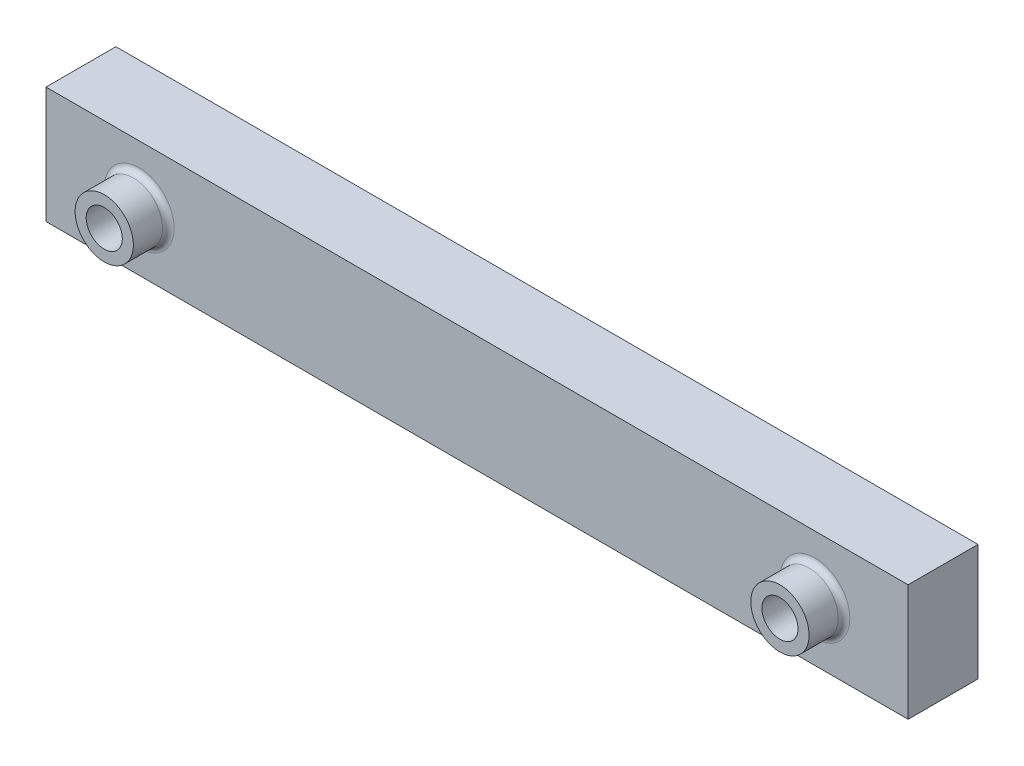
ISO-10303-21;
HEADER;
FILE_DESCRIPTION(('STEP AP214'),'2;1');
FILE_NAME('part.step','',(''),(''),'','','');
FILE_SCHEMA(('AUTOMOTIVE_DESIGN { 1 0 10303 214 1 1 1 1 }'));
ENDSEC;
DATA;
#1=APPLICATION_CONTEXT('core data for automotive mechanical design processes');
#2=APPLICATION_PROTOCOL_DEFINITION('international standard','automotive_design',2000,#1);
#3=PRODUCT_CONTEXT('',#1,'mechanical');
#4=PRODUCT('Part','Part','',(#3));
#5=PRODUCT_RELATED_PRODUCT_CATEGORY('part','',(#4));
#6=PRODUCT_DEFINITION_FORMATION('','',#4);
#7=PRODUCT_DEFINITION_CONTEXT('part definition',#1,'design');
#8=PRODUCT_DEFINITION('design','',#6,#7);
#9=PRODUCT_DEFINITION_SHAPE('','',#8);
#10=(LENGTH_UNIT() NAMED_UNIT(*) SI_UNIT(.MILLI.,.METRE.));
#11=(NAMED_UNIT(*) PLANE_ANGLE_UNIT() SI_UNIT($,.RADIAN.));
#12=(NAMED_UNIT(*) SI_UNIT($,.STERADIAN.) SOLID_ANGLE_UNIT());
#13=UNCERTAINTY_MEASURE_WITH_UNIT(LENGTH_MEASURE(1.E-05),#10,'distance_accuracy_value','');
#14=(GEOMETRIC_REPRESENTATION_CONTEXT(3) GLOBAL_UNCERTAINTY_ASSIGNED_CONTEXT((#13)) GLOBAL_UNIT_ASSIGNED_CONTEXT((#10,
#11,#12)) REPRESENTATION_CONTEXT('',''));
#15=CARTESIAN_POINT('',(0.,0.,0.));
#16=DIRECTION('',(0.,0.,1.));
#17=DIRECTION('',(1.,0.,0.));
#18=AXIS2_PLACEMENT_3D('',#15,#16,#17);
#19=CARTESIAN_POINT('',(0.,0.,6.));
#20=DIRECTION('',(0.,0.,1.));
#21=DIRECTION('',(1.,0.,0.));
#22=AXIS2_PLACEMENT_3D('',#19,#20,#21);
#23=PLANE('',#22);
#24=CARTESIAN_POINT('',(-16.0996168582375,1.33514516238047,6.));
#25=DIRECTION('',(0.,0.,1.));
#26=DIRECTION('',(1.,0.,0.));
#27=AXIS2_PLACEMENT_3D('',#24,#25,#26);
#28=CIRCLE('',#27,3.);
#29=CARTESIAN_POINT('',(-13.0996168582375,1.33514516238047,6.));
#30=VERTEX_POINT('',#29);
#31=EDGE_CURVE('E11',#30,#30,#28,.F.);
#32=ORIENTED_EDGE('',*,*,#31,.T.);
#33=EDGE_LOOP('',(#32));
#34=FACE_BOUND('',#33,.T.);
#35=CARTESIAN_POINT('',(41.9003831417625,1.33514516238047,6.));
#36=DIRECTION('',(0.,0.,1.));
#37=DIRECTION('',(1.,0.,0.));
#38=AXIS2_PLACEMENT_3D('',#35,#36,#37);
#39=CIRCLE('',#38,3.);
#40=CARTESIAN_POINT('',(44.9003831417625,1.33514516238047,6.));
#41=VERTEX_POINT('',#40);
#42=EDGE_CURVE('E121',#41,#41,#39,.F.);
#43=ORIENTED_EDGE('',*,*,#42,.T.);
#44=EDGE_LOOP('',(#43));
#45=FACE_BOUND('',#44,.T.);
#46=DIRECTION('',(0.,-1.,0.));
#47=VECTOR('',#46,1.);
#48=CARTESIAN_POINT('',(-24.0996168582375,6.33514516238047,6.));
#49=LINE('',#48,#47);
#50=CARTESIAN_POINT('',(-24.0996168582375,6.33514516238047,6.));
#51=VERTEX_POINT('',#50);
#52=CARTESIAN_POINT('',(-24.0996168582375,-3.66485483761953,6.));
#53=VERTEX_POINT('',#52);
#54=EDGE_CURVE('E87',#51,#53,#49,.T.);
#55=ORIENTED_EDGE('',*,*,#54,.T.);
#56=DIRECTION('',(1.,0.,0.));
#57=VECTOR('',#56,1.);
#58=CARTESIAN_POINT('',(-24.0996168582375,-3.66485483761953,6.));
#59=LINE('',#58,#57);
#60=CARTESIAN_POINT('',(49.9003831417625,-3.66485483761953,6.));
#61=VERTEX_POINT('',#60);
#62=EDGE_CURVE('E83',#53,#61,#59,.T.);
#63=ORIENTED_EDGE('',*,*,#62,.T.);
#64=DIRECTION('',(0.,1.,0.));
#65=VECTOR('',#64,1.);
#66=CARTESIAN_POINT('',(49.9003831417625,6.33514516238047,6.));
#67=LINE('',#66,#65);
#68=CARTESIAN_POINT('',(49.9003831417625,6.33514516238047,6.));
#69=VERTEX_POINT('',#68);
#70=EDGE_CURVE('E85',#61,#69,#67,.T.);
#71=ORIENTED_EDGE('',*,*,#70,.T.);
#72=DIRECTION('',(-1.,0.,0.));
#73=VECTOR('',#72,1.);
#74=CARTESIAN_POINT('',(-24.0996168582375,6.33514516238047,6.));
#75=LINE('',#74,#73);
#76=EDGE_CURVE('E52',#69,#51,#75,.T.);
#77=ORIENTED_EDGE('',*,*,#76,.T.);
#78=EDGE_LOOP('',(#55,#63,#71,#77));
#79=FACE_BOUND('',#78,.T.);
#80=ADVANCED_FACE('F35',(#34,#45,#79),#23,.T.);
#81=CARTESIAN_POINT('',(-24.0996168582375,6.33514516238047,6.));
#82=DIRECTION('',(1.,0.,0.));
#83=DIRECTION('',(0.,1.,0.));
#84=AXIS2_PLACEMENT_3D('',#81,#82,#83);
#85=PLANE('',#84);
#86=DIRECTION('',(0.,-1.,0.));
#87=VECTOR('',#86,1.);
#88=CARTESIAN_POINT('',(-24.0996168582375,6.33514516238047,0.));
#89=LINE('',#88,#87);
#90=CARTESIAN_POINT('',(-24.0996168582375,6.33514516238047,0.));
#91=VERTEX_POINT('',#90);
#92=CARTESIAN_POINT('',(-24.0996168582375,-3.66485483761953,0.));
#93=VERTEX_POINT('',#92);
#94=EDGE_CURVE('E102',#91,#93,#89,.T.);
#95=ORIENTED_EDGE('',*,*,#94,.T.);
#96=DIRECTION('',(0.,0.,-1.));
#97=VECTOR('',#96,1.);
#98=CARTESIAN_POINT('',(-24.0996168582375,-3.66485483761953,6.));
#99=LINE('',#98,#97);
#100=EDGE_CURVE('E93',#53,#93,#99,.T.);
#101=ORIENTED_EDGE('',*,*,#100,.F.);
#102=ORIENTED_EDGE('',*,*,#54,.F.);
#103=DIRECTION('',(0.,0.,-1.));
#104=VECTOR('',#103,1.);
#105=CARTESIAN_POINT('',(-24.0996168582375,6.33514516238047,6.));
#106=LINE('',#105,#104);
#107=EDGE_CURVE('E98',#51,#91,#106,.T.);
#108=ORIENTED_EDGE('',*,*,#107,.T.);
#109=EDGE_LOOP('',(#95,#101,#102,#108));
#110=FACE_BOUND('',#109,.T.);
#111=ADVANCED_FACE('F139',(#110),#85,.F.);
#112=CARTESIAN_POINT('',(-24.0996168582375,-3.66485483761953,6.));
#113=DIRECTION('',(0.,1.,0.));
#114=DIRECTION('',(0.,0.,1.));
#115=AXIS2_PLACEMENT_3D('',#112,#113,#114);
#116=PLANE('',#115);
#117=DIRECTION('',(1.,0.,0.));
#118=VECTOR('',#117,1.);
#119=CARTESIAN_POINT('',(-24.0996168582375,-3.66485483761953,0.));
#120=LINE('',#119,#118);
#121=CARTESIAN_POINT('',(49.9003831417625,-3.66485483761953,0.));
#122=VERTEX_POINT('',#121);
#123=EDGE_CURVE('E92',#93,#122,#120,.T.);
#124=ORIENTED_EDGE('',*,*,#123,.T.);
#125=DIRECTION('',(0.,0.,-1.));
#126=VECTOR('',#125,1.);
#127=CARTESIAN_POINT('',(49.9003831417625,-3.66485483761953,6.));
#128=LINE('',#127,#126);
#129=EDGE_CURVE('E90',#61,#122,#128,.T.);
#130=ORIENTED_EDGE('',*,*,#129,.F.);
#131=ORIENTED_EDGE('',*,*,#62,.F.);
#132=ORIENTED_EDGE('',*,*,#100,.T.);
#133=EDGE_LOOP('',(#124,#130,#131,#132));
#134=FACE_BOUND('',#133,.T.);
#135=ADVANCED_FACE('F91',(#134),#116,.F.);
#136=CARTESIAN_POINT('',(49.9003831417625,6.33514516238047,6.));
#137=DIRECTION('',(-1.,0.,0.));
#138=DIRECTION('',(0.,0.,1.));
#139=AXIS2_PLACEMENT_3D('',#136,#137,#138);
#140=PLANE('',#139);
#141=DIRECTION('',(0.,1.,0.));
#142=VECTOR('',#141,1.);
#143=CARTESIAN_POINT('',(49.9003831417625,6.33514516238047,0.));
#144=LINE('',#143,#142);
#145=CARTESIAN_POINT('',(49.9003831417625,6.33514516238047,0.));
#146=VERTEX_POINT('',#145);
#147=EDGE_CURVE('E69',#122,#146,#144,.T.);
#148=ORIENTED_EDGE('',*,*,#147,.T.);
#149=DIRECTION('',(0.,0.,-1.));
#150=VECTOR('',#149,1.);
#151=CARTESIAN_POINT('',(49.9003831417625,6.33514516238047,6.));
#152=LINE('',#151,#150);
#153=EDGE_CURVE('E94',#69,#146,#152,.T.);
#154=ORIENTED_EDGE('',*,*,#153,.F.);
#155=ORIENTED_EDGE('',*,*,#70,.F.);
#156=ORIENTED_EDGE('',*,*,#129,.T.);
#157=EDGE_LOOP('',(#148,#154,#155,#156));
#158=FACE_BOUND('',#157,.T.);
#159=ADVANCED_FACE('F96',(#158),#140,.F.);
#160=CARTESIAN_POINT('',(-24.0996168582375,6.33514516238047,6.));
#161=DIRECTION('',(0.,-1.,0.));
#162=DIRECTION('',(0.,0.,-1.));
#163=AXIS2_PLACEMENT_3D('',#160,#161,#162);
#164=PLANE('',#163);
#165=DIRECTION('',(-1.,0.,0.));
#166=VECTOR('',#165,1.);
#167=CARTESIAN_POINT('',(-24.0996168582375,6.33514516238047,0.));
#168=LINE('',#167,#166);
#169=EDGE_CURVE('E75',#146,#91,#168,.T.);
#170=ORIENTED_EDGE('',*,*,#169,.T.);
#171=ORIENTED_EDGE('',*,*,#107,.F.);
#172=ORIENTED_EDGE('',*,*,#76,.F.);
#173=ORIENTED_EDGE('',*,*,#153,.T.);
#174=EDGE_LOOP('',(#170,#171,#172,#173));
#175=FACE_BOUND('',#174,.T.);
#176=ADVANCED_FACE('F155',(#175),#164,.F.);
#177=CARTESIAN_POINT('',(0.,0.,0.));
#178=DIRECTION('',(0.,0.,1.));
#179=DIRECTION('',(1.,0.,0.));
#180=AXIS2_PLACEMENT_3D('',#177,#178,#179);
#181=PLANE('',#180);
#182=CARTESIAN_POINT('',(41.9003831417625,1.33514516238047,0.));
#183=DIRECTION('',(0.,0.,1.));
#184=DIRECTION('',(1.,0.,0.));
#185=AXIS2_PLACEMENT_3D('',#182,#183,#184);
#186=CIRCLE('',#185,1.55);
#187=CARTESIAN_POINT('',(43.4503831417625,1.33514516238047,0.));
#188=VERTEX_POINT('',#187);
#189=EDGE_CURVE('E115',#188,#188,#186,.T.);
#190=ORIENTED_EDGE('',*,*,#189,.T.);
#191=EDGE_LOOP('',(#190));
#192=FACE_BOUND('',#191,.T.);
#193=CARTESIAN_POINT('',(-16.0996168582375,1.33514516238047,0.));
#194=DIRECTION('',(0.,0.,1.));
#195=DIRECTION('',(1.,0.,0.));
#196=AXIS2_PLACEMENT_3D('',#193,#194,#195);
#197=CIRCLE('',#196,1.55);
#198=CARTESIAN_POINT('',(-14.5496168582375,1.33514516238047,0.));
#199=VERTEX_POINT('',#198);
#200=EDGE_CURVE('E105',#199,#199,#197,.T.);
#201=ORIENTED_EDGE('',*,*,#200,.T.);
#202=EDGE_LOOP('',(#201));
#203=FACE_BOUND('',#202,.T.);
#204=ORIENTED_EDGE('',*,*,#94,.F.);
#205=ORIENTED_EDGE('',*,*,#169,.F.);
#206=ORIENTED_EDGE('',*,*,#147,.F.);
#207=ORIENTED_EDGE('',*,*,#123,.F.);
#208=EDGE_LOOP('',(#204,#205,#206,#207));
#209=FACE_BOUND('',#208,.T.);
#210=ADVANCED_FACE('F152',(#192,#203,#209),#181,.F.);
#211=CARTESIAN_POINT('',(-16.0996168582375,1.33514516238047,-4.));
#212=DIRECTION('',(0.,0.,1.));
#213=DIRECTION('',(1.,0.,0.));
#214=AXIS2_PLACEMENT_3D('',#211,#212,#213);
#215=CYLINDRICAL_SURFACE('',#214,1.55);
#216=ORIENTED_EDGE('',*,*,#200,.F.);
#217=EDGE_LOOP('',(#216));
#218=FACE_BOUND('',#217,.T.);
#219=CARTESIAN_POINT('',(-16.0996168582375,1.33514516238047,9.));
#220=DIRECTION('',(0.,0.,1.));
#221=DIRECTION('',(1.,0.,0.));
#222=AXIS2_PLACEMENT_3D('',#219,#220,#221);
#223=CIRCLE('',#222,1.55);
#224=CARTESIAN_POINT('',(-14.5496168582375,1.33514516238047,9.));
#225=VERTEX_POINT('',#224);
#226=EDGE_CURVE('E271',#225,#225,#223,.T.);
#227=ORIENTED_EDGE('',*,*,#226,.T.);
#228=EDGE_LOOP('',(#227));
#229=FACE_BOUND('',#228,.T.);
#230=ADVANCED_FACE('F150',(#218,#229),#215,.F.);
#231=CARTESIAN_POINT('',(41.9003831417625,1.33514516238047,-4.));
#232=DIRECTION('',(0.,0.,1.));
#233=DIRECTION('',(1.,0.,0.));
#234=AXIS2_PLACEMENT_3D('',#231,#232,#233);
#235=CYLINDRICAL_SURFACE('',#234,1.55);
#236=ORIENTED_EDGE('',*,*,#189,.F.);
#237=EDGE_LOOP('',(#236));
#238=FACE_BOUND('',#237,.T.);
#239=CARTESIAN_POINT('',(41.9003831417625,1.33514516238047,9.));
#240=DIRECTION('',(0.,0.,1.));
#241=DIRECTION('',(1.,0.,0.));
#242=AXIS2_PLACEMENT_3D('',#239,#240,#241);
#243=CIRCLE('',#242,1.55000000000001);
#244=CARTESIAN_POINT('',(43.4503831417625,1.33514516238047,9.));
#245=VERTEX_POINT('',#244);
#246=EDGE_CURVE('E272',#245,#245,#243,.T.);
#247=ORIENTED_EDGE('',*,*,#246,.T.);
#248=EDGE_LOOP('',(#247));
#249=FACE_BOUND('',#248,.T.);
#250=ADVANCED_FACE('F184',(#238,#249),#235,.F.);
#251=CARTESIAN_POINT('',(-16.0996168582375,1.33514516238047,9.));
#252=DIRECTION('',(0.,0.,1.));
#253=DIRECTION('',(1.,0.,0.));
#254=AXIS2_PLACEMENT_3D('',#251,#252,#253);
#255=PLANE('',#254);
#256=CARTESIAN_POINT('',(-16.0996168582375,1.33514516238047,9.));
#257=DIRECTION('',(0.,0.,1.));
#258=DIRECTION('',(1.,0.,0.));
#259=AXIS2_PLACEMENT_3D('',#256,#257,#258);
#260=CIRCLE('',#259,2.5);
#261=CARTESIAN_POINT('',(-13.5996168582375,1.33514516238047,9.));
#262=VERTEX_POINT('',#261);
#263=EDGE_CURVE('E118',#262,#262,#260,.T.);
#264=ORIENTED_EDGE('',*,*,#263,.T.);
#265=EDGE_LOOP('',(#264));
#266=FACE_BOUND('',#265,.T.);
#267=ORIENTED_EDGE('',*,*,#226,.F.);
#268=EDGE_LOOP('',(#267));
#269=FACE_BOUND('',#268,.T.);
#270=ADVANCED_FACE('F191',(#266,#269),#255,.T.);
#271=CARTESIAN_POINT('',(-16.0996168582375,1.33514516238047,9.));
#272=DIRECTION('',(0.,0.,-1.));
#273=DIRECTION('',(-1.,0.,0.));
#274=AXIS2_PLACEMENT_3D('',#271,#272,#273);
#275=CYLINDRICAL_SURFACE('',#274,2.5);
#276=CARTESIAN_POINT('',(-16.0996168582375,1.33514516238047,6.5));
#277=DIRECTION('',(0.,0.,1.));
#278=DIRECTION('',(1.,0.,0.));
#279=AXIS2_PLACEMENT_3D('',#276,#277,#278);
#280=CIRCLE('',#279,2.5);
#281=CARTESIAN_POINT('',(-13.5996168582375,1.33514516238047,6.5));
#282=VERTEX_POINT('',#281);
#283=EDGE_CURVE('E44',#282,#282,#280,.T.);
#284=ORIENTED_EDGE('',*,*,#283,.T.);
#285=EDGE_LOOP('',(#284));
#286=FACE_BOUND('',#285,.T.);
#287=ORIENTED_EDGE('',*,*,#263,.F.);
#288=EDGE_LOOP('',(#287));
#289=FACE_BOUND('',#288,.T.);
#290=ADVANCED_FACE('F126',(#286,#289),#275,.T.);
#291=CARTESIAN_POINT('',(41.9003831417625,1.33514516238047,9.));
#292=DIRECTION('',(0.,0.,1.));
#293=DIRECTION('',(1.,0.,0.));
#294=AXIS2_PLACEMENT_3D('',#291,#292,#293);
#295=PLANE('',#294);
#296=CARTESIAN_POINT('',(41.9003831417625,1.33514516238047,9.));
#297=DIRECTION('',(0.,0.,1.));
#298=DIRECTION('',(1.,0.,0.));
#299=AXIS2_PLACEMENT_3D('',#296,#297,#298);
#300=CIRCLE('',#299,2.5);
#301=CARTESIAN_POINT('',(44.4003831417625,1.33514516238047,9.));
#302=VERTEX_POINT('',#301);
#303=EDGE_CURVE('E270',#302,#302,#300,.T.);
#304=ORIENTED_EDGE('',*,*,#303,.T.);
#305=EDGE_LOOP('',(#304));
#306=FACE_BOUND('',#305,.T.);
#307=ORIENTED_EDGE('',*,*,#246,.F.);
#308=EDGE_LOOP('',(#307));
#309=FACE_BOUND('',#308,.T.);
#310=ADVANCED_FACE('F206',(#306,#309),#295,.T.);
#311=CARTESIAN_POINT('',(41.9003831417625,1.33514516238047,9.));
#312=DIRECTION('',(0.,0.,-1.));
#313=DIRECTION('',(-1.,0.,0.));
#314=AXIS2_PLACEMENT_3D('',#311,#312,#313);
#315=CYLINDRICAL_SURFACE('',#314,2.5);
#316=CARTESIAN_POINT('',(41.9003831417625,1.33514516238047,6.5));
#317=DIRECTION('',(0.,0.,1.));
#318=DIRECTION('',(1.,0.,0.));
#319=AXIS2_PLACEMENT_3D('',#316,#317,#318);
#320=CIRCLE('',#319,2.5);
#321=CARTESIAN_POINT('',(44.4003831417625,1.33514516238047,6.5));
#322=VERTEX_POINT('',#321);
#323=EDGE_CURVE('E112',#322,#322,#320,.T.);
#324=ORIENTED_EDGE('',*,*,#323,.T.);
#325=EDGE_LOOP('',(#324));
#326=FACE_BOUND('',#325,.T.);
#327=ORIENTED_EDGE('',*,*,#303,.F.);
#328=EDGE_LOOP('',(#327));
#329=FACE_BOUND('',#328,.T.);
#330=ADVANCED_FACE('F135',(#326,#329),#315,.T.);
#331=CARTESIAN_POINT('',(41.9003831417625,1.33514516238047,6.5));
#332=DIRECTION('',(0.,0.,1.));
#333=DIRECTION('',(1.,0.,0.));
#334=AXIS2_PLACEMENT_3D('',#331,#332,#333);
#335=TOROIDAL_SURFACE('',#334,3.,0.5);
#336=ORIENTED_EDGE('',*,*,#42,.F.);
#337=EDGE_LOOP('',(#336));
#338=FACE_BOUND('',#337,.T.);
#339=ORIENTED_EDGE('',*,*,#323,.F.);
#340=EDGE_LOOP('',(#339));
#341=FACE_BOUND('',#340,.T.);
#342=ADVANCED_FACE('F130',(#338,#341),#335,.F.);
#343=CARTESIAN_POINT('',(-16.0996168582375,1.33514516238047,6.5));
#344=DIRECTION('',(0.,0.,1.));
#345=DIRECTION('',(1.,0.,0.));
#346=AXIS2_PLACEMENT_3D('',#343,#344,#345);
#347=TOROIDAL_SURFACE('',#346,3.,0.5);
#348=ORIENTED_EDGE('',*,*,#31,.F.);
#349=EDGE_LOOP('',(#348));
#350=FACE_BOUND('',#349,.T.);
#351=ORIENTED_EDGE('',*,*,#283,.F.);
#352=EDGE_LOOP('',(#351));
#353=FACE_BOUND('',#352,.T.);
#354=ADVANCED_FACE('F37',(#350,#353),#347,.F.);
#355=CLOSED_SHELL('',(#80,#111,#135,#159,#176,#210,#230,#250,#270,#290,#310,#330,#342,#354));
#356=MANIFOLD_SOLID_BREP('B2',#355);
#357=ADVANCED_BREP_SHAPE_REPRESENTATION('',(#18,#356),#14);
#358=SHAPE_DEFINITION_REPRESENTATION(#9,#357);
ENDSEC;
END-ISO-10303-21;
